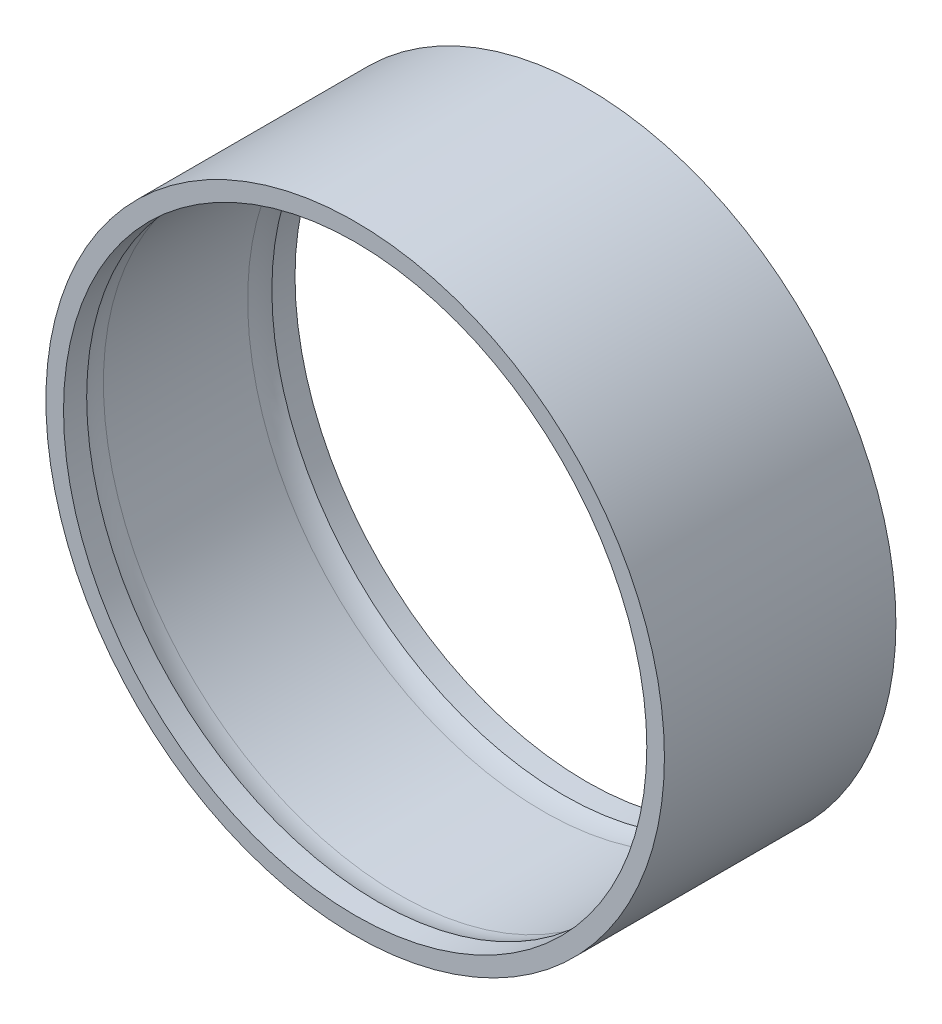
ISO-10303-21;
HEADER;
FILE_DESCRIPTION(('STEP AP214'),'2;1');
FILE_NAME('part.step','',(''),(''),'','','');
FILE_SCHEMA(('AUTOMOTIVE_DESIGN { 1 0 10303 214 1 1 1 1 }'));
ENDSEC;
DATA;
#1=APPLICATION_CONTEXT('core data for automotive mechanical design processes');
#2=APPLICATION_PROTOCOL_DEFINITION('international standard','automotive_design',2000,#1);
#3=PRODUCT_CONTEXT('',#1,'mechanical');
#4=PRODUCT('Part','Part','',(#3));
#5=PRODUCT_RELATED_PRODUCT_CATEGORY('part','',(#4));
#6=PRODUCT_DEFINITION_FORMATION('','',#4);
#7=PRODUCT_DEFINITION_CONTEXT('part definition',#1,'design');
#8=PRODUCT_DEFINITION('design','',#6,#7);
#9=PRODUCT_DEFINITION_SHAPE('','',#8);
#10=(LENGTH_UNIT() NAMED_UNIT(*) SI_UNIT(.MILLI.,.METRE.));
#11=(NAMED_UNIT(*) PLANE_ANGLE_UNIT() SI_UNIT($,.RADIAN.));
#12=(NAMED_UNIT(*) SI_UNIT($,.STERADIAN.) SOLID_ANGLE_UNIT());
#13=UNCERTAINTY_MEASURE_WITH_UNIT(LENGTH_MEASURE(1.E-05),#10,'distance_accuracy_value','');
#14=(GEOMETRIC_REPRESENTATION_CONTEXT(3) GLOBAL_UNCERTAINTY_ASSIGNED_CONTEXT((#13)) GLOBAL_UNIT_ASSIGNED_CONTEXT((#10,
#11,#12)) REPRESENTATION_CONTEXT('',''));
#15=CARTESIAN_POINT('',(0.,0.,0.));
#16=DIRECTION('',(0.,0.,1.));
#17=DIRECTION('',(1.,0.,0.));
#18=AXIS2_PLACEMENT_3D('',#15,#16,#17);
#19=CARTESIAN_POINT('',(0.,0.,-15.875));
#20=DIRECTION('',(0.,0.,1.));
#21=DIRECTION('',(-1.,0.,0.));
#22=AXIS2_PLACEMENT_3D('',#19,#20,#21);
#23=CYLINDRICAL_SURFACE('',#22,40.);
#24=CARTESIAN_POINT('',(0.,0.,-15.875));
#25=DIRECTION('',(0.,0.,1.));
#26=DIRECTION('',(1.,0.,0.));
#27=AXIS2_PLACEMENT_3D('',#24,#25,#26);
#28=CIRCLE('',#27,40.);
#29=CARTESIAN_POINT('',(40.,0.,-15.875));
#30=VERTEX_POINT('',#29);
#31=EDGE_CURVE('E43',#30,#30,#28,.T.);
#32=ORIENTED_EDGE('',*,*,#31,.F.);
#33=EDGE_LOOP('',(#32));
#34=FACE_BOUND('',#33,.T.);
#35=CARTESIAN_POINT('',(0.,0.,-12.7));
#36=DIRECTION('',(0.,0.,1.));
#37=DIRECTION('',(1.,0.,0.));
#38=AXIS2_PLACEMENT_3D('',#35,#36,#37);
#39=CIRCLE('',#38,40.);
#40=CARTESIAN_POINT('',(40.,0.,-12.7));
#41=VERTEX_POINT('',#40);
#42=EDGE_CURVE('E48',#41,#41,#39,.T.);
#43=ORIENTED_EDGE('',*,*,#42,.T.);
#44=EDGE_LOOP('',(#43));
#45=FACE_BOUND('',#44,.T.);
#46=ADVANCED_FACE('F32',(#34,#45),#23,.F.);
#47=CARTESIAN_POINT('',(0.,0.,15.875));
#48=DIRECTION('',(0.,0.,1.));
#49=DIRECTION('',(1.,0.,0.));
#50=AXIS2_PLACEMENT_3D('',#47,#48,#49);
#51=CIRCLE('',#50,40.);
#52=CARTESIAN_POINT('',(40.,0.,15.875));
#53=VERTEX_POINT('',#52);
#54=EDGE_CURVE('E45',#53,#53,#51,.T.);
#55=ORIENTED_EDGE('',*,*,#54,.T.);
#56=EDGE_LOOP('',(#55));
#57=FACE_BOUND('',#56,.T.);
#58=CARTESIAN_POINT('',(0.,0.,12.7));
#59=DIRECTION('',(0.,0.,1.));
#60=DIRECTION('',(1.,0.,0.));
#61=AXIS2_PLACEMENT_3D('',#58,#59,#60);
#62=CIRCLE('',#61,40.);
#63=CARTESIAN_POINT('',(40.,0.,12.7));
#64=VERTEX_POINT('',#63);
#65=EDGE_CURVE('E59',#64,#64,#62,.T.);
#66=ORIENTED_EDGE('',*,*,#65,.F.);
#67=EDGE_LOOP('',(#66));
#68=FACE_BOUND('',#67,.T.);
#69=ADVANCED_FACE('F65',(#57,#68),#23,.F.);
#70=CARTESIAN_POINT('',(0.,0.,-15.875));
#71=DIRECTION('',(0.,0.,-1.));
#72=DIRECTION('',(1.,0.,0.));
#73=AXIS2_PLACEMENT_3D('',#70,#71,#72);
#74=PLANE('',#73);
#75=CARTESIAN_POINT('',(0.,0.,-15.875));
#76=DIRECTION('',(0.,0.,1.));
#77=DIRECTION('',(1.,0.,0.));
#78=AXIS2_PLACEMENT_3D('',#75,#76,#77);
#79=CIRCLE('',#78,42.418);
#80=CARTESIAN_POINT('',(42.418,0.,-15.875));
#81=VERTEX_POINT('',#80);
#82=EDGE_CURVE('E10',#81,#81,#79,.T.);
#83=ORIENTED_EDGE('',*,*,#82,.F.);
#84=EDGE_LOOP('',(#83));
#85=FACE_BOUND('',#84,.T.);
#86=ORIENTED_EDGE('',*,*,#31,.T.);
#87=EDGE_LOOP('',(#86));
#88=FACE_BOUND('',#87,.T.);
#89=ADVANCED_FACE('F67',(#85,#88),#74,.T.);
#90=CARTESIAN_POINT('',(0.,0.,15.875));
#91=DIRECTION('',(0.,0.,-1.));
#92=DIRECTION('',(1.,0.,0.));
#93=AXIS2_PLACEMENT_3D('',#90,#91,#92);
#94=PLANE('',#93);
#95=CARTESIAN_POINT('',(0.,0.,15.875));
#96=DIRECTION('',(0.,0.,1.));
#97=DIRECTION('',(1.,0.,0.));
#98=AXIS2_PLACEMENT_3D('',#95,#96,#97);
#99=CIRCLE('',#98,42.418);
#100=CARTESIAN_POINT('',(42.418,0.,15.875));
#101=VERTEX_POINT('',#100);
#102=EDGE_CURVE('E36',#101,#101,#99,.T.);
#103=ORIENTED_EDGE('',*,*,#102,.T.);
#104=EDGE_LOOP('',(#103));
#105=FACE_BOUND('',#104,.T.);
#106=ORIENTED_EDGE('',*,*,#54,.F.);
#107=EDGE_LOOP('',(#106));
#108=FACE_BOUND('',#107,.T.);
#109=ADVANCED_FACE('F74',(#105,#108),#94,.F.);
#110=CARTESIAN_POINT('',(0.,0.,-15.875));
#111=DIRECTION('',(0.,0.,1.));
#112=DIRECTION('',(-1.,0.,0.));
#113=AXIS2_PLACEMENT_3D('',#110,#111,#112);
#114=CYLINDRICAL_SURFACE('',#113,42.418);
#115=ORIENTED_EDGE('',*,*,#82,.T.);
#116=EDGE_LOOP('',(#115));
#117=FACE_BOUND('',#116,.T.);
#118=ORIENTED_EDGE('',*,*,#102,.F.);
#119=EDGE_LOOP('',(#118));
#120=FACE_BOUND('',#119,.T.);
#121=ADVANCED_FACE('F34',(#117,#120),#114,.T.);
#122=CARTESIAN_POINT('',(0.,0.,-9.89274048224964));
#123=DIRECTION('',(0.,0.,-1.));
#124=DIRECTION('',(1.,0.,0.));
#125=AXIS2_PLACEMENT_3D('',#122,#123,#124);
#126=TOROIDAL_SURFACE('',#125,32.5755,7.9375);
#127=ORIENTED_EDGE('',*,*,#42,.F.);
#128=EDGE_LOOP('',(#127));
#129=FACE_BOUND('',#128,.T.);
#130=CARTESIAN_POINT('',(0.,0.,-9.89274048224964));
#131=DIRECTION('',(0.,0.,1.));
#132=DIRECTION('',(1.,0.,0.));
#133=AXIS2_PLACEMENT_3D('',#130,#131,#132);
#134=CIRCLE('',#133,40.513);
#135=CARTESIAN_POINT('',(40.513,0.,-9.89274048224964));
#136=VERTEX_POINT('',#135);
#137=EDGE_CURVE('E53',#136,#136,#134,.T.);
#138=ORIENTED_EDGE('',*,*,#137,.T.);
#139=EDGE_LOOP('',(#138));
#140=FACE_BOUND('',#139,.T.);
#141=ADVANCED_FACE('F79',(#129,#140),#126,.F.);
#142=CARTESIAN_POINT('',(0.,0.,-15.875));
#143=DIRECTION('',(0.,0.,-1.));
#144=DIRECTION('',(1.,0.,0.));
#145=AXIS2_PLACEMENT_3D('',#142,#143,#144);
#146=CYLINDRICAL_SURFACE('',#145,40.513);
#147=ORIENTED_EDGE('',*,*,#137,.F.);
#148=EDGE_LOOP('',(#147));
#149=FACE_BOUND('',#148,.T.);
#150=CARTESIAN_POINT('',(0.,0.,9.89274048224964));
#151=DIRECTION('',(0.,0.,1.));
#152=DIRECTION('',(1.,0.,0.));
#153=AXIS2_PLACEMENT_3D('',#150,#151,#152);
#154=CIRCLE('',#153,40.513);
#155=CARTESIAN_POINT('',(40.513,0.,9.89274048224964));
#156=VERTEX_POINT('',#155);
#157=EDGE_CURVE('E56',#156,#156,#154,.T.);
#158=ORIENTED_EDGE('',*,*,#157,.T.);
#159=EDGE_LOOP('',(#158));
#160=FACE_BOUND('',#159,.T.);
#161=ADVANCED_FACE('F93',(#149,#160),#146,.F.);
#162=CARTESIAN_POINT('',(0.,0.,9.89274048224964));
#163=DIRECTION('',(0.,0.,-1.));
#164=DIRECTION('',(1.,0.,0.));
#165=AXIS2_PLACEMENT_3D('',#162,#163,#164);
#166=TOROIDAL_SURFACE('',#165,32.5755,7.9375);
#167=ORIENTED_EDGE('',*,*,#157,.F.);
#168=EDGE_LOOP('',(#167));
#169=FACE_BOUND('',#168,.T.);
#170=ORIENTED_EDGE('',*,*,#65,.T.);
#171=EDGE_LOOP('',(#170));
#172=FACE_BOUND('',#171,.T.);
#173=ADVANCED_FACE('F63',(#169,#172),#166,.F.);
#174=CLOSED_SHELL('',(#46,#69,#89,#109,#121,#141,#161,#173));
#175=MANIFOLD_SOLID_BREP('B2',#174);
#176=ADVANCED_BREP_SHAPE_REPRESENTATION('',(#18,#175),#14);
#177=SHAPE_DEFINITION_REPRESENTATION(#9,#176);
ENDSEC;
END-ISO-10303-21;
